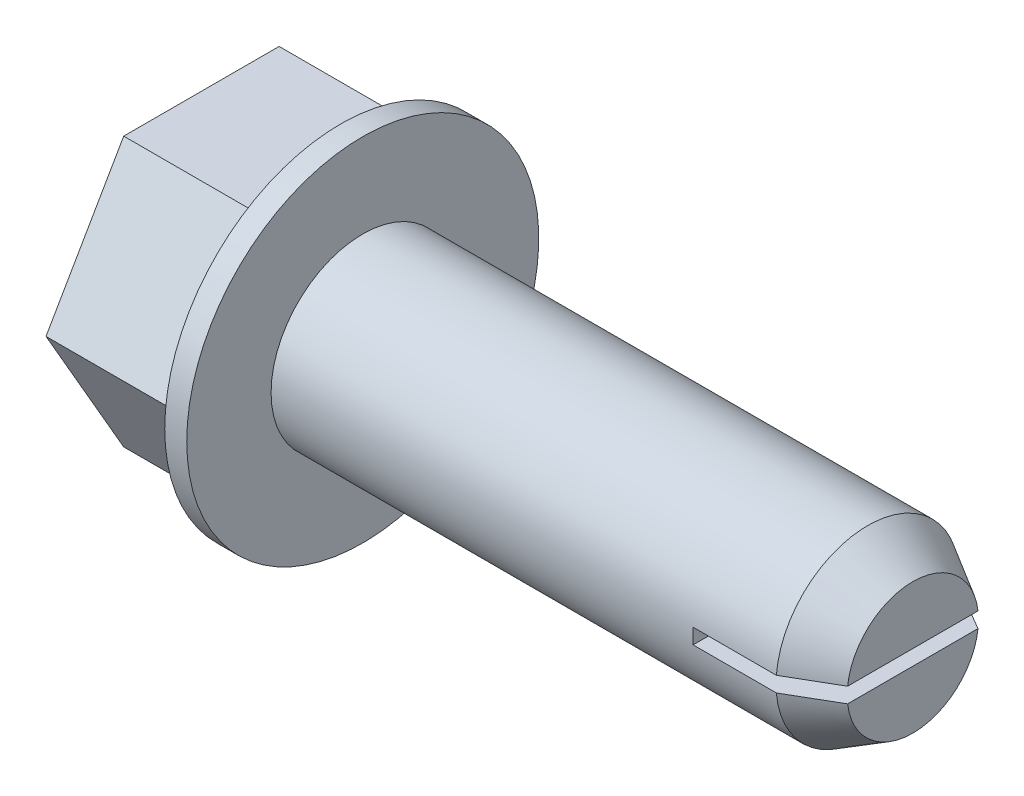
ISO-10303-21;
HEADER;
FILE_DESCRIPTION(('STEP AP214'),'2;1');
FILE_NAME('part.step','',(''),(''),'','','');
FILE_SCHEMA(('AUTOMOTIVE_DESIGN { 1 0 10303 214 1 1 1 1 }'));
ENDSEC;
DATA;
#1=APPLICATION_CONTEXT('core data for automotive mechanical design processes');
#2=APPLICATION_PROTOCOL_DEFINITION('international standard','automotive_design',2000,#1);
#3=PRODUCT_CONTEXT('',#1,'mechanical');
#4=PRODUCT('Part','Part','',(#3));
#5=PRODUCT_RELATED_PRODUCT_CATEGORY('part','',(#4));
#6=PRODUCT_DEFINITION_FORMATION('','',#4);
#7=PRODUCT_DEFINITION_CONTEXT('part definition',#1,'design');
#8=PRODUCT_DEFINITION('design','',#6,#7);
#9=PRODUCT_DEFINITION_SHAPE('','',#8);
#10=(LENGTH_UNIT() NAMED_UNIT(*) SI_UNIT(.MILLI.,.METRE.));
#11=(NAMED_UNIT(*) PLANE_ANGLE_UNIT() SI_UNIT($,.RADIAN.));
#12=(NAMED_UNIT(*) SI_UNIT($,.STERADIAN.) SOLID_ANGLE_UNIT());
#13=UNCERTAINTY_MEASURE_WITH_UNIT(LENGTH_MEASURE(1.E-05),#10,'distance_accuracy_value','');
#14=(GEOMETRIC_REPRESENTATION_CONTEXT(3) GLOBAL_UNCERTAINTY_ASSIGNED_CONTEXT((#13)) GLOBAL_UNIT_ASSIGNED_CONTEXT((#10,
#11,#12)) REPRESENTATION_CONTEXT('',''));
#15=CARTESIAN_POINT('',(0.,0.,0.));
#16=DIRECTION('',(0.,0.,1.));
#17=DIRECTION('',(1.,0.,0.));
#18=AXIS2_PLACEMENT_3D('',#15,#16,#17);
#19=CARTESIAN_POINT('',(-4.6228,3.72872,0.));
#20=DIRECTION('',(1.,0.,0.));
#21=DIRECTION('',(0.,0.,-1.));
#22=AXIS2_PLACEMENT_3D('',#19,#20,#21);
#23=PLANE('',#22);
#24=CARTESIAN_POINT('',(-4.6228,0.,0.));
#25=DIRECTION('',(-1.,0.,0.));
#26=DIRECTION('',(0.,0.,1.));
#27=AXIS2_PLACEMENT_3D('',#24,#25,#26);
#28=CIRCLE('',#27,3.72872);
#29=CARTESIAN_POINT('',(-4.6228,0.,3.72872));
#30=VERTEX_POINT('',#29);
#31=EDGE_CURVE('E22',#30,#30,#28,.T.);
#32=ORIENTED_EDGE('',*,*,#31,.T.);
#33=EDGE_LOOP('',(#32));
#34=FACE_BOUND('',#33,.T.);
#35=ADVANCED_FACE('F19',(#34),#23,.F.);
#36=CARTESIAN_POINT('',(0.,0.,0.));
#37=DIRECTION('',(-1.,0.,0.));
#38=DIRECTION('',(0.,0.,1.));
#39=AXIS2_PLACEMENT_3D('',#36,#37,#38);
#40=CYLINDRICAL_SURFACE('',#39,3.72872);
#41=ORIENTED_EDGE('',*,*,#31,.F.);
#42=EDGE_LOOP('',(#41));
#43=FACE_BOUND('',#42,.T.);
#44=CARTESIAN_POINT('',(-5.588,0.,0.));
#45=DIRECTION('',(-1.,0.,0.));
#46=DIRECTION('',(0.,0.,1.));
#47=AXIS2_PLACEMENT_3D('',#44,#45,#46);
#48=CIRCLE('',#47,3.72872);
#49=CARTESIAN_POINT('',(-5.588,0.,3.72872));
#50=VERTEX_POINT('',#49);
#51=EDGE_CURVE('E155',#50,#50,#48,.T.);
#52=ORIENTED_EDGE('',*,*,#51,.T.);
#53=EDGE_LOOP('',(#52));
#54=FACE_BOUND('',#53,.T.);
#55=ADVANCED_FACE('F377',(#43,#54),#40,.F.);
#56=CARTESIAN_POINT('',(-5.588,4.6609,0.));
#57=DIRECTION('',(1.,0.,0.));
#58=DIRECTION('',(0.,0.,-1.));
#59=AXIS2_PLACEMENT_3D('',#56,#57,#58);
#60=PLANE('',#59);
#61=DIRECTION('',(0.,0.,-1.));
#62=VECTOR('',#61,1.);
#63=CARTESIAN_POINT('',(-5.58799999998882,-4.6609,0.));
#64=LINE('',#63,#62);
#65=CARTESIAN_POINT('',(-5.58800000007968,-4.6609,2.69097186966593));
#66=VERTEX_POINT('',#65);
#67=CARTESIAN_POINT('',(-5.58799999999441,-4.6609,-2.69097186966593));
#68=VERTEX_POINT('',#67);
#69=EDGE_CURVE('E151',#66,#68,#64,.T.);
#70=ORIENTED_EDGE('',*,*,#69,.F.);
#71=DIRECTION('',(0.,-0.866025403784439,-0.5));
#72=VECTOR('',#71,1.);
#73=CARTESIAN_POINT('',(-5.5880000002162,-10.7431892055105,-0.820639440424718));
#74=LINE('',#73,#72);
#75=CARTESIAN_POINT('',(-5.58800000007968,0.,5.38194373933185));
#76=VERTEX_POINT('',#75);
#77=EDGE_CURVE('E146',#76,#66,#74,.T.);
#78=ORIENTED_EDGE('',*,*,#77,.F.);
#79=DIRECTION('',(0.,-0.866025403784439,0.5));
#80=VECTOR('',#79,1.);
#81=CARTESIAN_POINT('',(-5.58799999998882,-6.08228920551051,8.8935550494225));
#82=LINE('',#81,#80);
#83=CARTESIAN_POINT('',(-5.58799999999441,4.6609,2.69097186966593));
#84=VERTEX_POINT('',#83);
#85=EDGE_CURVE('E142',#84,#76,#82,.T.);
#86=ORIENTED_EDGE('',*,*,#85,.F.);
#87=DIRECTION('',(0.,0.,1.));
#88=VECTOR('',#87,1.);
#89=CARTESIAN_POINT('',(-5.58799999998882,4.6609,0.));
#90=LINE('',#89,#88);
#91=CARTESIAN_POINT('',(-5.58800000007968,4.6609,-2.69097186966593));
#92=VERTEX_POINT('',#91);
#93=EDGE_CURVE('E165',#92,#84,#90,.T.);
#94=ORIENTED_EDGE('',*,*,#93,.F.);
#95=DIRECTION('',(0.,0.866025403784439,0.5));
#96=VECTOR('',#95,1.);
#97=CARTESIAN_POINT('',(-5.5880000002162,-6.08228920551051,-8.8935550494225));
#98=LINE('',#97,#96);
#99=CARTESIAN_POINT('',(-5.58800000016215,0.,-5.38194373933185));
#100=VERTEX_POINT('',#99);
#101=EDGE_CURVE('E355',#100,#92,#98,.T.);
#102=ORIENTED_EDGE('',*,*,#101,.F.);
#103=DIRECTION('',(0.,0.866025403784439,-0.5));
#104=VECTOR('',#103,1.);
#105=CARTESIAN_POINT('',(-5.58799999998882,-10.7431892055105,0.82063944042472));
#106=LINE('',#105,#104);
#107=EDGE_CURVE('E314',#68,#100,#106,.T.);
#108=ORIENTED_EDGE('',*,*,#107,.F.);
#109=EDGE_LOOP('',(#70,#78,#86,#94,#102,#108));
#110=FACE_BOUND('',#109,.T.);
#111=ORIENTED_EDGE('',*,*,#51,.F.);
#112=EDGE_LOOP('',(#111));
#113=FACE_BOUND('',#112,.T.);
#114=ADVANCED_FACE('F148',(#110,#113),#60,.F.);
#115=CARTESIAN_POINT('',(500000.,-10.7431892055105,-0.820639440424718));
#116=DIRECTION('',(0.,-0.5,0.866025403784439));
#117=DIRECTION('',(0.,-0.866025403784439,-0.5));
#118=AXIS2_PLACEMENT_3D('',#115,#116,#117);
#119=PLANE('',#118);
#120=DIRECTION('',(0.,0.866025403784439,0.5));
#121=VECTOR('',#120,1.);
#122=CARTESIAN_POINT('',(-0.762,-4.6609,2.69097186966593));
#123=LINE('',#122,#121);
#124=CARTESIAN_POINT('',(-0.762000000091873,-4.6609,2.69097186966593));
#125=VERTEX_POINT('',#124);
#126=CARTESIAN_POINT('',(-0.762000000177139,0.,5.38194373933185));
#127=VERTEX_POINT('',#126);
#128=EDGE_CURVE('E161',#125,#127,#123,.T.);
#129=ORIENTED_EDGE('',*,*,#128,.T.);
#130=DIRECTION('',(1.,0.,0.));
#131=VECTOR('',#130,1.);
#132=CARTESIAN_POINT('',(500000.,0.,5.38194373933185));
#133=LINE('',#132,#131);
#134=EDGE_CURVE('E158',#76,#127,#133,.T.);
#135=ORIENTED_EDGE('',*,*,#134,.F.);
#136=ORIENTED_EDGE('',*,*,#77,.T.);
#137=DIRECTION('',(1.,0.,0.));
#138=VECTOR('',#137,1.);
#139=CARTESIAN_POINT('',(500000.,-4.6609,2.69097186966593));
#140=LINE('',#139,#138);
#141=EDGE_CURVE('E309',#125,#66,#140,.F.);
#142=ORIENTED_EDGE('',*,*,#141,.F.);
#143=EDGE_LOOP('',(#129,#135,#136,#142));
#144=FACE_BOUND('',#143,.T.);
#145=ADVANCED_FACE('F159',(#144),#119,.T.);
#146=CARTESIAN_POINT('',(500000.,-6.08228920551051,8.8935550494225));
#147=DIRECTION('',(0.,0.5,0.866025403784439));
#148=DIRECTION('',(0.,-0.866025403784439,0.5));
#149=AXIS2_PLACEMENT_3D('',#146,#147,#148);
#150=PLANE('',#149);
#151=DIRECTION('',(0.,0.866025403784439,-0.5));
#152=VECTOR('',#151,1.);
#153=CARTESIAN_POINT('',(-0.762,0.,5.38194373933185));
#154=LINE('',#153,#152);
#155=CARTESIAN_POINT('',(-0.762000000006608,4.6609,2.69097186966593));
#156=VERTEX_POINT('',#155);
#157=EDGE_CURVE('E550',#127,#156,#154,.T.);
#158=ORIENTED_EDGE('',*,*,#157,.T.);
#159=DIRECTION('',(1.,0.,0.));
#160=VECTOR('',#159,1.);
#161=CARTESIAN_POINT('',(500000.,4.6609,2.69097186966592));
#162=LINE('',#161,#160);
#163=EDGE_CURVE('E169',#84,#156,#162,.T.);
#164=ORIENTED_EDGE('',*,*,#163,.F.);
#165=ORIENTED_EDGE('',*,*,#85,.T.);
#166=ORIENTED_EDGE('',*,*,#134,.T.);
#167=EDGE_LOOP('',(#158,#164,#165,#166));
#168=FACE_BOUND('',#167,.T.);
#169=ADVANCED_FACE('F167',(#168),#150,.T.);
#170=CARTESIAN_POINT('',(500000.,4.6609,0.));
#171=DIRECTION('',(0.,1.,0.));
#172=DIRECTION('',(0.,0.,1.));
#173=AXIS2_PLACEMENT_3D('',#170,#171,#172);
#174=PLANE('',#173);
#175=DIRECTION('',(0.,0.,-1.));
#176=VECTOR('',#175,1.);
#177=CARTESIAN_POINT('',(-0.762,4.6609,0.));
#178=LINE('',#177,#176);
#179=CARTESIAN_POINT('',(-0.762000000049241,4.6609,-2.69097186966592));
#180=VERTEX_POINT('',#179);
#181=EDGE_CURVE('E351',#156,#180,#178,.T.);
#182=ORIENTED_EDGE('',*,*,#181,.T.);
#183=DIRECTION('',(1.,0.,0.));
#184=VECTOR('',#183,1.);
#185=CARTESIAN_POINT('',(500000.,4.6609,-2.69097186966592));
#186=LINE('',#185,#184);
#187=EDGE_CURVE('E352',#92,#180,#186,.T.);
#188=ORIENTED_EDGE('',*,*,#187,.F.);
#189=ORIENTED_EDGE('',*,*,#93,.T.);
#190=ORIENTED_EDGE('',*,*,#163,.T.);
#191=EDGE_LOOP('',(#182,#188,#189,#190));
#192=FACE_BOUND('',#191,.T.);
#193=ADVANCED_FACE('F367',(#192),#174,.T.);
#194=CARTESIAN_POINT('',(500000.,-6.08228920551051,-8.8935550494225));
#195=DIRECTION('',(0.,0.5,-0.866025403784439));
#196=DIRECTION('',(0.,0.866025403784439,0.5));
#197=AXIS2_PLACEMENT_3D('',#194,#195,#196);
#198=PLANE('',#197);
#199=DIRECTION('',(0.,-0.866025403784439,-0.5));
#200=VECTOR('',#199,1.);
#201=CARTESIAN_POINT('',(-0.762,4.6609,-2.69097186966593));
#202=LINE('',#201,#200);
#203=CARTESIAN_POINT('',(-0.762000000148717,0.,-5.38194373933185));
#204=VERTEX_POINT('',#203);
#205=EDGE_CURVE('E297',#180,#204,#202,.T.);
#206=ORIENTED_EDGE('',*,*,#205,.T.);
#207=DIRECTION('',(1.,0.,0.));
#208=VECTOR('',#207,1.);
#209=CARTESIAN_POINT('',(500000.,0.,-5.38194373933185));
#210=LINE('',#209,#208);
#211=EDGE_CURVE('E354',#100,#204,#210,.T.);
#212=ORIENTED_EDGE('',*,*,#211,.F.);
#213=ORIENTED_EDGE('',*,*,#101,.T.);
#214=ORIENTED_EDGE('',*,*,#187,.T.);
#215=EDGE_LOOP('',(#206,#212,#213,#214));
#216=FACE_BOUND('',#215,.T.);
#217=ADVANCED_FACE('F371',(#216),#198,.T.);
#218=CARTESIAN_POINT('',(500000.,-10.7431892055105,0.82063944042472));
#219=DIRECTION('',(0.,-0.5,-0.866025403784439));
#220=DIRECTION('',(0.,0.866025403784439,-0.5));
#221=AXIS2_PLACEMENT_3D('',#218,#219,#220);
#222=PLANE('',#221);
#223=DIRECTION('',(1.,0.,0.));
#224=VECTOR('',#223,1.);
#225=CARTESIAN_POINT('',(500000.,-4.6609,-2.69097186966593));
#226=LINE('',#225,#224);
#227=CARTESIAN_POINT('',(-0.761999999949765,-4.6609,-2.69097186966593));
#228=VERTEX_POINT('',#227);
#229=EDGE_CURVE('E304',#68,#228,#226,.T.);
#230=ORIENTED_EDGE('',*,*,#229,.F.);
#231=ORIENTED_EDGE('',*,*,#107,.T.);
#232=ORIENTED_EDGE('',*,*,#211,.T.);
#233=DIRECTION('',(0.,-0.866025403784439,0.499999999999999));
#234=VECTOR('',#233,1.);
#235=CARTESIAN_POINT('',(-0.762,0.,-5.38194373933185));
#236=LINE('',#235,#234);
#237=EDGE_CURVE('E101',#204,#228,#236,.T.);
#238=ORIENTED_EDGE('',*,*,#237,.T.);
#239=EDGE_LOOP('',(#230,#231,#232,#238));
#240=FACE_BOUND('',#239,.T.);
#241=ADVANCED_FACE('F372',(#240),#222,.T.);
#242=CARTESIAN_POINT('',(500000.,-4.6609,0.));
#243=DIRECTION('',(0.,-1.,0.));
#244=DIRECTION('',(0.,0.,-1.));
#245=AXIS2_PLACEMENT_3D('',#242,#243,#244);
#246=PLANE('',#245);
#247=DIRECTION('',(0.,0.,-1.));
#248=VECTOR('',#247,1.);
#249=CARTESIAN_POINT('',(-0.762,-4.6609,0.));
#250=LINE('',#249,#248);
#251=EDGE_CURVE('E289',#228,#125,#250,.F.);
#252=ORIENTED_EDGE('',*,*,#251,.T.);
#253=ORIENTED_EDGE('',*,*,#141,.T.);
#254=ORIENTED_EDGE('',*,*,#69,.T.);
#255=ORIENTED_EDGE('',*,*,#229,.T.);
#256=EDGE_LOOP('',(#252,#253,#254,#255));
#257=FACE_BOUND('',#256,.T.);
#258=ADVANCED_FACE('F409',(#257),#246,.T.);
#259=CARTESIAN_POINT('',(-0.762,6.096,0.));
#260=DIRECTION('',(1.,0.,0.));
#261=DIRECTION('',(0.,0.,-1.));
#262=AXIS2_PLACEMENT_3D('',#259,#260,#261);
#263=PLANE('',#262);
#264=CARTESIAN_POINT('',(-0.762,0.,0.));
#265=DIRECTION('',(-1.,0.,0.));
#266=DIRECTION('',(0.,0.,1.));
#267=AXIS2_PLACEMENT_3D('',#264,#265,#266);
#268=CIRCLE('',#267,6.096);
#269=CARTESIAN_POINT('',(-0.762,0.,6.096));
#270=VERTEX_POINT('',#269);
#271=EDGE_CURVE('E293',#270,#270,#268,.F.);
#272=ORIENTED_EDGE('',*,*,#271,.F.);
#273=EDGE_LOOP('',(#272));
#274=FACE_BOUND('',#273,.T.);
#275=ORIENTED_EDGE('',*,*,#237,.F.);
#276=ORIENTED_EDGE('',*,*,#205,.F.);
#277=ORIENTED_EDGE('',*,*,#181,.F.);
#278=ORIENTED_EDGE('',*,*,#157,.F.);
#279=ORIENTED_EDGE('',*,*,#128,.F.);
#280=ORIENTED_EDGE('',*,*,#251,.F.);
#281=EDGE_LOOP('',(#275,#276,#277,#278,#279,#280));
#282=FACE_BOUND('',#281,.T.);
#283=ADVANCED_FACE('F404',(#274,#282),#263,.F.);
#284=CARTESIAN_POINT('',(19.05,3.175,0.));
#285=DIRECTION('',(-1.,0.,0.));
#286=DIRECTION('',(0.,0.,1.));
#287=AXIS2_PLACEMENT_3D('',#284,#285,#286);
#288=PLANE('',#287);
#289=DIRECTION('',(0.,0.,-1.));
#290=VECTOR('',#289,1.);
#291=CARTESIAN_POINT('',(19.05,-0.264583333333333,-6.096));
#292=LINE('',#291,#290);
#293=CARTESIAN_POINT('',(19.0500000000004,-0.264583333333333,-2.25785042680903));
#294=VERTEX_POINT('',#293);
#295=CARTESIAN_POINT('',(19.0499999999965,-0.264583333333333,2.25785042681133));
#296=VERTEX_POINT('',#295);
#297=EDGE_CURVE('E239',#294,#296,#292,.F.);
#298=ORIENTED_EDGE('',*,*,#297,.T.);
#299=CARTESIAN_POINT('',(19.0499999999929,0.,0.));
#300=DIRECTION('',(-1.,0.,0.));
#301=DIRECTION('',(0.,0.,1.));
#302=AXIS2_PLACEMENT_3D('',#299,#300,#301);
#303=CIRCLE('',#302,2.27330000003061);
#304=EDGE_CURVE('E88',#294,#296,#303,.T.);
#305=ORIENTED_EDGE('',*,*,#304,.F.);
#306=EDGE_LOOP('',(#298,#305));
#307=FACE_BOUND('',#306,.T.);
#308=ADVANCED_FACE('F399',(#307),#288,.F.);
#309=CARTESIAN_POINT('',(0.,0.,0.));
#310=DIRECTION('',(-1.,0.,0.));
#311=DIRECTION('',(0.,0.,1.));
#312=AXIS2_PLACEMENT_3D('',#309,#310,#311);
#313=CYLINDRICAL_SURFACE('',#312,6.096);
#314=ORIENTED_EDGE('',*,*,#271,.T.);
#315=EDGE_LOOP('',(#314));
#316=FACE_BOUND('',#315,.T.);
#317=CARTESIAN_POINT('',(0.,0.,0.));
#318=DIRECTION('',(-1.,0.,0.));
#319=DIRECTION('',(0.,0.,1.));
#320=AXIS2_PLACEMENT_3D('',#317,#318,#319);
#321=CIRCLE('',#320,6.096);
#322=CARTESIAN_POINT('',(0.,0.,6.096));
#323=VERTEX_POINT('',#322);
#324=EDGE_CURVE('E246',#323,#323,#321,.T.);
#325=ORIENTED_EDGE('',*,*,#324,.T.);
#326=EDGE_LOOP('',(#325));
#327=FACE_BOUND('',#326,.T.);
#328=ADVANCED_FACE('F397',(#316,#327),#313,.T.);
#329=CARTESIAN_POINT('',(17.488209787075,0.,0.));
#330=DIRECTION('',(-1.,0.,0.));
#331=DIRECTION('',(0.,0.,1.));
#332=AXIS2_PLACEMENT_3D('',#329,#330,#331);
#333=CONICAL_SURFACE('',#332,3.17499999988513,0.523598775602448);
#334=CARTESIAN_POINT('',(17.4882097868304,-0.264583333333333,-3.16395648830533));
#335=CARTESIAN_POINT('',(17.7485950521458,-0.264583333333333,-3.01308870934584));
#336=CARTESIAN_POINT('',(18.0089562455111,-0.264583333333333,-2.86217927282826));
#337=CARTESIAN_POINT('',(18.3994183217583,-0.264583333333333,-2.63567773139847));
#338=CARTESIAN_POINT('',(18.5295590617472,-0.264583333333333,-2.56015431969282));
#339=CARTESIAN_POINT('',(18.7898067189707,-0.264583333333333,-2.40904920796175));
#340=CARTESIAN_POINT('',(18.9199136362009,-0.264583333333333,-2.333467507929));
#341=CARTESIAN_POINT('',(19.0500000000079,-0.264583333333333,-2.25785042680467));
#342=B_SPLINE_CURVE_WITH_KNOTS('',3,(#334,#335,#336,#337,#338,#339,#340,#341),.UNSPECIFIED.,.F.,
.F.,(4,2,2,4),(0.,0.902803568709945,1.35420535449983,1.80560719706211),.UNSPECIFIED.);
#343=CARTESIAN_POINT('',(17.4882097868228,-0.264583333333333,-3.16395648829212));
#344=VERTEX_POINT('',#343);
#345=EDGE_CURVE('E232',#344,#294,#342,.T.);
#346=ORIENTED_EDGE('',*,*,#345,.T.);
#347=ORIENTED_EDGE('',*,*,#304,.T.);
#348=CARTESIAN_POINT('',(19.0500000000073,-0.264583333333333,2.257850426805));
#349=CARTESIAN_POINT('',(18.9199136362004,-0.264583333333333,2.3334675079293));
#350=CARTESIAN_POINT('',(18.7898067189702,-0.264583333333333,2.40904920796202));
#351=CARTESIAN_POINT('',(18.5295590617469,-0.264583333333333,2.56015431969304));
#352=CARTESIAN_POINT('',(18.3994183217579,-0.264583333333333,2.63567773139866));
#353=CARTESIAN_POINT('',(18.0089562455109,-0.264583333333333,2.86217927282837));
#354=CARTESIAN_POINT('',(17.7485950521457,-0.264583333333333,3.01308870934589));
#355=CARTESIAN_POINT('',(17.4882097868304,-0.264583333333333,3.16395648830533));
#356=B_SPLINE_CURVE_WITH_KNOTS('',3,(#348,#349,#350,#351,#352,#353,#354,#355),.UNSPECIFIED.,.F.,
.F.,(4,2,2,4),(0.,0.451401842562117,0.902803628351839,1.80560719706146),.UNSPECIFIED.);
#357=CARTESIAN_POINT('',(17.4882097868228,-0.264583333333333,3.16395648829212));
#358=VERTEX_POINT('',#357);
#359=EDGE_CURVE('E226',#296,#358,#356,.T.);
#360=ORIENTED_EDGE('',*,*,#359,.T.);
#361=CARTESIAN_POINT('',(17.4882097868151,0.,0.));
#362=DIRECTION('',(-1.,0.,0.));
#363=DIRECTION('',(0.,0.,1.));
#364=AXIS2_PLACEMENT_3D('',#361,#362,#363);
#365=CIRCLE('',#364,3.175);
#366=EDGE_CURVE('E280',#344,#358,#365,.T.);
#367=ORIENTED_EDGE('',*,*,#366,.F.);
#368=EDGE_LOOP('',(#346,#347,#360,#367));
#369=FACE_BOUND('',#368,.T.);
#370=ADVANCED_FACE('F220',(#369),#333,.T.);
#371=CARTESIAN_POINT('',(14.605,-0.264583333333333,-6.096));
#372=DIRECTION('',(0.,-1.,0.));
#373=DIRECTION('',(0.,0.,-1.));
#374=AXIS2_PLACEMENT_3D('',#371,#372,#373);
#375=PLANE('',#374);
#376=ORIENTED_EDGE('',*,*,#297,.F.);
#377=ORIENTED_EDGE('',*,*,#345,.F.);
#378=DIRECTION('',(-1.,0.,0.));
#379=VECTOR('',#378,1.);
#380=CARTESIAN_POINT('',(0.,-0.264583333333333,-3.16395648827891));
#381=LINE('',#380,#379);
#382=CARTESIAN_POINT('',(14.605,-0.264583333333333,-3.16395648827891));
#383=VERTEX_POINT('',#382);
#384=EDGE_CURVE('E256',#383,#344,#381,.F.);
#385=ORIENTED_EDGE('',*,*,#384,.F.);
#386=DIRECTION('',(0.,0.,1.));
#387=VECTOR('',#386,1.);
#388=CARTESIAN_POINT('',(14.605,-0.264583333333333,-6.096));
#389=LINE('',#388,#387);
#390=CARTESIAN_POINT('',(14.605,-0.264583333333333,3.16395648827891));
#391=VERTEX_POINT('',#390);
#392=EDGE_CURVE('E252',#383,#391,#389,.T.);
#393=ORIENTED_EDGE('',*,*,#392,.T.);
#394=DIRECTION('',(-1.,0.,0.));
#395=VECTOR('',#394,1.);
#396=CARTESIAN_POINT('',(0.,-0.264583333333333,3.16395648827891));
#397=LINE('',#396,#395);
#398=EDGE_CURVE('E260',#358,#391,#397,.T.);
#399=ORIENTED_EDGE('',*,*,#398,.F.);
#400=ORIENTED_EDGE('',*,*,#359,.F.);
#401=EDGE_LOOP('',(#376,#377,#385,#393,#399,#400));
#402=FACE_BOUND('',#401,.T.);
#403=ADVANCED_FACE('F215',(#402),#375,.F.);
#404=CARTESIAN_POINT('',(14.605,0.264583333333333,-6.096));
#405=DIRECTION('',(-1.,0.,0.));
#406=DIRECTION('',(0.,0.,1.));
#407=AXIS2_PLACEMENT_3D('',#404,#405,#406);
#408=PLANE('',#407);
#409=DIRECTION('',(0.,0.,1.));
#410=VECTOR('',#409,1.);
#411=CARTESIAN_POINT('',(14.605,0.264583333333333,-6.096));
#412=LINE('',#411,#410);
#413=CARTESIAN_POINT('',(14.605,0.264583333333334,-3.16395648827891));
#414=VERTEX_POINT('',#413);
#415=CARTESIAN_POINT('',(14.605,0.264583333333333,3.16395648827891));
#416=VERTEX_POINT('',#415);
#417=EDGE_CURVE('E262',#414,#416,#412,.T.);
#418=ORIENTED_EDGE('',*,*,#417,.T.);
#419=CARTESIAN_POINT('',(14.605,0.,0.));
#420=DIRECTION('',(-1.,0.,0.));
#421=DIRECTION('',(0.,0.,1.));
#422=AXIS2_PLACEMENT_3D('',#419,#420,#421);
#423=CIRCLE('',#422,3.175);
#424=EDGE_CURVE('E257',#391,#416,#423,.T.);
#425=ORIENTED_EDGE('',*,*,#424,.F.);
#426=ORIENTED_EDGE('',*,*,#392,.F.);
#427=CARTESIAN_POINT('',(14.605,0.,0.));
#428=DIRECTION('',(-1.,0.,0.));
#429=DIRECTION('',(0.,0.,1.));
#430=AXIS2_PLACEMENT_3D('',#427,#428,#429);
#431=CIRCLE('',#430,3.175);
#432=EDGE_CURVE('E251',#414,#383,#431,.T.);
#433=ORIENTED_EDGE('',*,*,#432,.F.);
#434=EDGE_LOOP('',(#418,#425,#426,#433));
#435=FACE_BOUND('',#434,.T.);
#436=ADVANCED_FACE('F211',(#435),#408,.F.);
#437=CARTESIAN_POINT('',(19.05,3.175,0.));
#438=DIRECTION('',(-1.,0.,0.));
#439=DIRECTION('',(0.,0.,1.));
#440=AXIS2_PLACEMENT_3D('',#437,#438,#439);
#441=PLANE('',#440);
#442=DIRECTION('',(0.,0.,1.));
#443=VECTOR('',#442,1.);
#444=CARTESIAN_POINT('',(19.05,0.264583333333333,-6.096));
#445=LINE('',#444,#443);
#446=CARTESIAN_POINT('',(19.0500000000004,0.264583333333333,2.25785042680903));
#447=VERTEX_POINT('',#446);
#448=CARTESIAN_POINT('',(19.0499999999965,0.264583333333333,-2.25785042681133));
#449=VERTEX_POINT('',#448);
#450=EDGE_CURVE('E189',#447,#449,#445,.F.);
#451=ORIENTED_EDGE('',*,*,#450,.T.);
#452=CARTESIAN_POINT('',(19.0499999999929,0.,0.));
#453=DIRECTION('',(-1.,0.,0.));
#454=DIRECTION('',(0.,0.,1.));
#455=AXIS2_PLACEMENT_3D('',#452,#453,#454);
#456=CIRCLE('',#455,2.27330000003061);
#457=EDGE_CURVE('E259',#447,#449,#456,.T.);
#458=ORIENTED_EDGE('',*,*,#457,.F.);
#459=EDGE_LOOP('',(#451,#458));
#460=FACE_BOUND('',#459,.T.);
#461=ADVANCED_FACE('F207',(#460),#441,.F.);
#462=CARTESIAN_POINT('',(0.,3.175,0.));
#463=DIRECTION('',(-1.,0.,0.));
#464=DIRECTION('',(0.,0.,1.));
#465=AXIS2_PLACEMENT_3D('',#462,#463,#464);
#466=PLANE('',#465);
#467=CARTESIAN_POINT('',(0.,0.,0.));
#468=DIRECTION('',(-1.,0.,0.));
#469=DIRECTION('',(0.,0.,1.));
#470=AXIS2_PLACEMENT_3D('',#467,#468,#469);
#471=CIRCLE('',#470,3.175);
#472=CARTESIAN_POINT('',(0.,0.,3.175));
#473=VERTEX_POINT('',#472);
#474=EDGE_CURVE('E177',#473,#473,#471,.F.);
#475=ORIENTED_EDGE('',*,*,#474,.F.);
#476=EDGE_LOOP('',(#475));
#477=FACE_BOUND('',#476,.T.);
#478=ORIENTED_EDGE('',*,*,#324,.F.);
#479=EDGE_LOOP('',(#478));
#480=FACE_BOUND('',#479,.T.);
#481=ADVANCED_FACE('F203',(#477,#480),#466,.F.);
#482=CARTESIAN_POINT('',(17.488209787075,0.,0.));
#483=DIRECTION('',(-1.,0.,0.));
#484=DIRECTION('',(0.,0.,1.));
#485=AXIS2_PLACEMENT_3D('',#482,#483,#484);
#486=CONICAL_SURFACE('',#485,3.17499999988513,0.523598775602448);
#487=CARTESIAN_POINT('',(17.4882097868351,0.264583333333333,3.16395648830265));
#488=CARTESIAN_POINT('',(17.7485950521496,0.264583333333333,3.0130887093436));
#489=CARTESIAN_POINT('',(18.0089562455142,0.264583333333333,2.86217927282647));
#490=CARTESIAN_POINT('',(18.3994183217602,0.264583333333333,2.63567773139735));
#491=CARTESIAN_POINT('',(18.5295590617488,0.264583333333333,2.56015431969193));
#492=CARTESIAN_POINT('',(18.7898067189715,0.264583333333333,2.40904920796131));
#493=CARTESIAN_POINT('',(18.9199136362013,0.264583333333333,2.33346750792877));
#494=CARTESIAN_POINT('',(19.0500000000079,0.264583333333333,2.25785042680467));
#495=B_SPLINE_CURVE_WITH_KNOTS('',3,(#487,#488,#489,#490,#491,#492,#493,#494),.UNSPECIFIED.,.F.,
.F.,(4,2,2,4),(0.,0.902803568707271,1.35420535449581,1.80560719705676),.UNSPECIFIED.);
#496=CARTESIAN_POINT('',(17.4882097868251,0.264583333333333,3.16395648829078));
#497=VERTEX_POINT('',#496);
#498=EDGE_CURVE('E190',#497,#447,#495,.T.);
#499=ORIENTED_EDGE('',*,*,#498,.T.);
#500=ORIENTED_EDGE('',*,*,#457,.T.);
#501=CARTESIAN_POINT('',(19.0500000000051,0.264583333333333,-2.25785042680627));
#502=CARTESIAN_POINT('',(18.9199136361991,0.264583333333333,-2.33346750793001));
#503=CARTESIAN_POINT('',(18.7898067189699,0.264583333333333,-2.40904920796219));
#504=CARTESIAN_POINT('',(18.5295590617485,0.264583333333333,-2.5601543196921));
#505=CARTESIAN_POINT('',(18.3994183217605,0.264583333333333,-2.63567773139716));
#506=CARTESIAN_POINT('',(18.0089562455164,0.264583333333333,-2.86217927282522));
#507=CARTESIAN_POINT('',(17.748595052153,0.264583333333333,-3.01308870934164));
#508=CARTESIAN_POINT('',(17.4882097868397,0.264583333333333,-3.16395648829997));
#509=B_SPLINE_CURVE_WITH_KNOTS('',3,(#501,#502,#503,#504,#505,#506,#507,#508),.UNSPECIFIED.,.F.,
.F.,(4,2,2,4),(0.,0.451401842558815,0.902803628345232,1.80560719704824),.UNSPECIFIED.);
#510=CARTESIAN_POINT('',(17.4882097868274,0.264583333333334,-3.16395648828944));
#511=VERTEX_POINT('',#510);
#512=EDGE_CURVE('E43',#449,#511,#509,.T.);
#513=ORIENTED_EDGE('',*,*,#512,.T.);
#514=CARTESIAN_POINT('',(17.4882097868151,0.,0.));
#515=DIRECTION('',(-1.,0.,0.));
#516=DIRECTION('',(0.,0.,1.));
#517=AXIS2_PLACEMENT_3D('',#514,#515,#516);
#518=CIRCLE('',#517,3.175);
#519=EDGE_CURVE('E30',#497,#511,#518,.T.);
#520=ORIENTED_EDGE('',*,*,#519,.F.);
#521=EDGE_LOOP('',(#499,#500,#513,#520));
#522=FACE_BOUND('',#521,.T.);
#523=ADVANCED_FACE('F199',(#522),#486,.T.);
#524=CARTESIAN_POINT('',(14.605,0.264583333333333,-6.096));
#525=DIRECTION('',(0.,1.,0.));
#526=DIRECTION('',(0.,0.,1.));
#527=AXIS2_PLACEMENT_3D('',#524,#525,#526);
#528=PLANE('',#527);
#529=ORIENTED_EDGE('',*,*,#450,.F.);
#530=ORIENTED_EDGE('',*,*,#498,.F.);
#531=DIRECTION('',(-1.,0.,0.));
#532=VECTOR('',#531,1.);
#533=CARTESIAN_POINT('',(0.,0.264583333333334,3.16395648827891));
#534=LINE('',#533,#532);
#535=EDGE_CURVE('E181',#416,#497,#534,.F.);
#536=ORIENTED_EDGE('',*,*,#535,.F.);
#537=ORIENTED_EDGE('',*,*,#417,.F.);
#538=DIRECTION('',(-1.,0.,0.));
#539=VECTOR('',#538,1.);
#540=CARTESIAN_POINT('',(0.,0.264583333333334,-3.16395648827891));
#541=LINE('',#540,#539);
#542=EDGE_CURVE('E12',#511,#414,#541,.T.);
#543=ORIENTED_EDGE('',*,*,#542,.F.);
#544=ORIENTED_EDGE('',*,*,#512,.F.);
#545=EDGE_LOOP('',(#529,#530,#536,#537,#543,#544));
#546=FACE_BOUND('',#545,.T.);
#547=ADVANCED_FACE('F196',(#546),#528,.F.);
#548=CARTESIAN_POINT('',(0.,0.,0.));
#549=DIRECTION('',(-1.,0.,0.));
#550=DIRECTION('',(0.,0.,1.));
#551=AXIS2_PLACEMENT_3D('',#548,#549,#550);
#552=CYLINDRICAL_SURFACE('',#551,3.175);
#553=ORIENTED_EDGE('',*,*,#474,.T.);
#554=EDGE_LOOP('',(#553));
#555=FACE_BOUND('',#554,.T.);
#556=ORIENTED_EDGE('',*,*,#519,.T.);
#557=ORIENTED_EDGE('',*,*,#542,.T.);
#558=ORIENTED_EDGE('',*,*,#432,.T.);
#559=ORIENTED_EDGE('',*,*,#384,.T.);
#560=ORIENTED_EDGE('',*,*,#366,.T.);
#561=ORIENTED_EDGE('',*,*,#398,.T.);
#562=ORIENTED_EDGE('',*,*,#424,.T.);
#563=ORIENTED_EDGE('',*,*,#535,.T.);
#564=EDGE_LOOP('',(#556,#557,#558,#559,#560,#561,#562,#563));
#565=FACE_BOUND('',#564,.T.);
#566=ADVANCED_FACE('F341',(#555,#565),#552,.T.);
#567=CLOSED_SHELL('',(#35,#55,#114,#145,#169,#193,#217,#241,#258,#283,#308,#328,#370,#403,#436,
#461,#481,#523,#547,#566));
#568=MANIFOLD_SOLID_BREP('B1',#567);
#569=ADVANCED_BREP_SHAPE_REPRESENTATION('',(#18,#568),#14);
#570=SHAPE_DEFINITION_REPRESENTATION(#9,#569);
ENDSEC;
END-ISO-10303-21;
